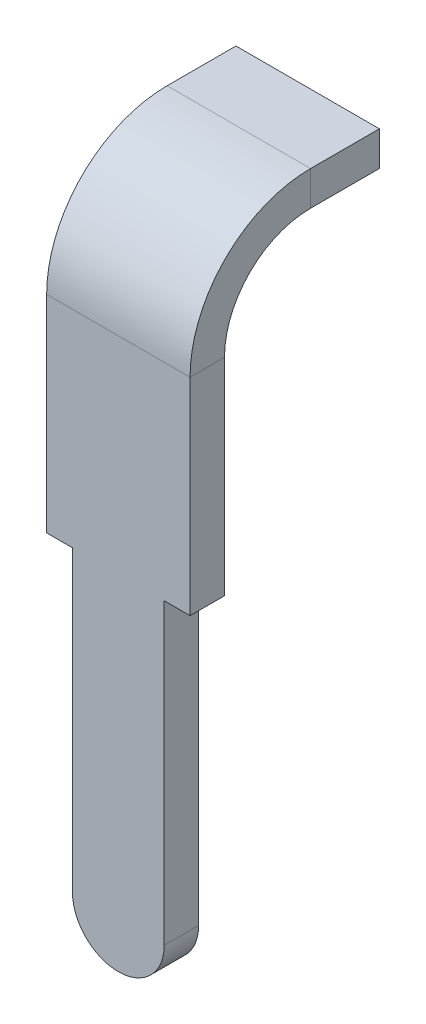
ISO-10303-21;
HEADER;
FILE_DESCRIPTION(('STEP AP214'),'2;1');
FILE_NAME('part.step','',(''),(''),'','','');
FILE_SCHEMA(('AUTOMOTIVE_DESIGN { 1 0 10303 214 1 1 1 1 }'));
ENDSEC;
DATA;
#1=APPLICATION_CONTEXT('core data for automotive mechanical design processes');
#2=APPLICATION_PROTOCOL_DEFINITION('international standard','automotive_design',2000,#1);
#3=PRODUCT_CONTEXT('',#1,'mechanical');
#4=PRODUCT('Part','Part','',(#3));
#5=PRODUCT_RELATED_PRODUCT_CATEGORY('part','',(#4));
#6=PRODUCT_DEFINITION_FORMATION('','',#4);
#7=PRODUCT_DEFINITION_CONTEXT('part definition',#1,'design');
#8=PRODUCT_DEFINITION('design','',#6,#7);
#9=PRODUCT_DEFINITION_SHAPE('','',#8);
#10=(LENGTH_UNIT() NAMED_UNIT(*) SI_UNIT(.MILLI.,.METRE.));
#11=(NAMED_UNIT(*) PLANE_ANGLE_UNIT() SI_UNIT($,.RADIAN.));
#12=(NAMED_UNIT(*) SI_UNIT($,.STERADIAN.) SOLID_ANGLE_UNIT());
#13=UNCERTAINTY_MEASURE_WITH_UNIT(LENGTH_MEASURE(1.E-05),#10,'distance_accuracy_value','');
#14=(GEOMETRIC_REPRESENTATION_CONTEXT(3) GLOBAL_UNCERTAINTY_ASSIGNED_CONTEXT((#13)) GLOBAL_UNIT_ASSIGNED_CONTEXT((#10,
#11,#12)) REPRESENTATION_CONTEXT('',''));
#15=CARTESIAN_POINT('',(0.,0.,0.));
#16=DIRECTION('',(0.,0.,1.));
#17=DIRECTION('',(1.,0.,0.));
#18=AXIS2_PLACEMENT_3D('',#15,#16,#17);
#19=CARTESIAN_POINT('',(0.,-4.3,-5.5));
#20=DIRECTION('',(0.,0.,1.));
#21=DIRECTION('',(0.,-1.,0.));
#22=AXIS2_PLACEMENT_3D('',#19,#20,#21);
#23=CYLINDRICAL_SURFACE('',#22,0.4);
#24=CARTESIAN_POINT('',(0.,-4.3,7.15));
#25=DIRECTION('',(0.,0.,1.));
#26=DIRECTION('',(1.,0.,0.));
#27=AXIS2_PLACEMENT_3D('',#24,#25,#26);
#28=CIRCLE('',#27,0.4);
#29=CARTESIAN_POINT('',(0.,-4.7,7.15));
#30=VERTEX_POINT('',#29);
#31=CARTESIAN_POINT('',(0.4,-4.3,7.15));
#32=VERTEX_POINT('',#31);
#33=EDGE_CURVE('E286',#30,#32,#28,.T.);
#34=ORIENTED_EDGE('',*,*,#33,.F.);
#35=DIRECTION('',(0.,0.,-1.));
#36=VECTOR('',#35,1.);
#37=CARTESIAN_POINT('',(0.,-4.7,6.85));
#38=LINE('',#37,#36);
#39=CARTESIAN_POINT('',(0.,-4.7,6.85));
#40=VERTEX_POINT('',#39);
#41=EDGE_CURVE('E11',#30,#40,#38,.T.);
#42=ORIENTED_EDGE('',*,*,#41,.T.);
#43=CARTESIAN_POINT('',(0.,-4.3,6.85));
#44=DIRECTION('',(0.,0.,-1.));
#45=DIRECTION('',(-1.,0.,0.));
#46=AXIS2_PLACEMENT_3D('',#43,#44,#45);
#47=CIRCLE('',#46,0.4);
#48=CARTESIAN_POINT('',(0.4,-4.3,6.85));
#49=VERTEX_POINT('',#48);
#50=EDGE_CURVE('E184',#49,#40,#47,.T.);
#51=ORIENTED_EDGE('',*,*,#50,.F.);
#52=DIRECTION('',(0.,0.,-1.));
#53=VECTOR('',#52,1.);
#54=CARTESIAN_POINT('',(0.4,-4.3,6.85));
#55=LINE('',#54,#53);
#56=EDGE_CURVE('E193',#32,#49,#55,.T.);
#57=ORIENTED_EDGE('',*,*,#56,.F.);
#58=EDGE_LOOP('',(#34,#42,#51,#57));
#59=FACE_BOUND('',#58,.T.);
#60=ADVANCED_FACE('F17',(#59),#23,.T.);
#61=CARTESIAN_POINT('',(0.,-4.3,-5.5));
#62=DIRECTION('',(0.,0.,-1.));
#63=DIRECTION('',(0.,1.,0.));
#64=AXIS2_PLACEMENT_3D('',#61,#62,#63);
#65=CYLINDRICAL_SURFACE('',#64,0.4);
#66=ORIENTED_EDGE('',*,*,#41,.F.);
#67=CARTESIAN_POINT('',(0.,-4.3,7.15));
#68=DIRECTION('',(0.,0.,1.));
#69=DIRECTION('',(1.,0.,0.));
#70=AXIS2_PLACEMENT_3D('',#67,#68,#69);
#71=CIRCLE('',#70,0.4);
#72=CARTESIAN_POINT('',(-0.4,-4.3,7.15));
#73=VERTEX_POINT('',#72);
#74=EDGE_CURVE('E282',#73,#30,#71,.T.);
#75=ORIENTED_EDGE('',*,*,#74,.F.);
#76=DIRECTION('',(0.,0.,1.));
#77=VECTOR('',#76,1.);
#78=CARTESIAN_POINT('',(-0.4,-4.3,7.15));
#79=LINE('',#78,#77);
#80=CARTESIAN_POINT('',(-0.4,-4.3,6.85));
#81=VERTEX_POINT('',#80);
#82=EDGE_CURVE('E25',#81,#73,#79,.T.);
#83=ORIENTED_EDGE('',*,*,#82,.F.);
#84=CARTESIAN_POINT('',(0.,-4.3,6.85));
#85=DIRECTION('',(0.,0.,-1.));
#86=DIRECTION('',(-1.,0.,0.));
#87=AXIS2_PLACEMENT_3D('',#84,#85,#86);
#88=CIRCLE('',#87,0.4);
#89=EDGE_CURVE('E187',#40,#81,#88,.T.);
#90=ORIENTED_EDGE('',*,*,#89,.F.);
#91=EDGE_LOOP('',(#66,#75,#83,#90));
#92=FACE_BOUND('',#91,.T.);
#93=ADVANCED_FACE('F283',(#92),#65,.T.);
#94=CARTESIAN_POINT('',(-0.4,-4.7,-5.5));
#95=DIRECTION('',(1.,0.,0.));
#96=DIRECTION('',(0.,1.,0.));
#97=AXIS2_PLACEMENT_3D('',#94,#95,#96);
#98=PLANE('',#97);
#99=DIRECTION('',(0.,-1.,0.));
#100=VECTOR('',#99,1.);
#101=CARTESIAN_POINT('',(-0.4,0.1,6.85));
#102=LINE('',#101,#100);
#103=CARTESIAN_POINT('',(-0.4,-1.7,6.85));
#104=VERTEX_POINT('',#103);
#105=EDGE_CURVE('E152',#104,#81,#102,.T.);
#106=ORIENTED_EDGE('',*,*,#105,.T.);
#107=ORIENTED_EDGE('',*,*,#82,.T.);
#108=DIRECTION('',(0.,1.,0.));
#109=VECTOR('',#108,1.);
#110=CARTESIAN_POINT('',(-0.4,-4.7,7.15));
#111=LINE('',#110,#109);
#112=CARTESIAN_POINT('',(-0.4,-1.7,7.15));
#113=VERTEX_POINT('',#112);
#114=EDGE_CURVE('E173',#73,#113,#111,.T.);
#115=ORIENTED_EDGE('',*,*,#114,.T.);
#116=DIRECTION('',(0.,0.,1.));
#117=VECTOR('',#116,1.);
#118=CARTESIAN_POINT('',(-0.4,-1.7,-5.5));
#119=LINE('',#118,#117);
#120=EDGE_CURVE('E268',#104,#113,#119,.T.);
#121=ORIENTED_EDGE('',*,*,#120,.F.);
#122=EDGE_LOOP('',(#106,#107,#115,#121));
#123=FACE_BOUND('',#122,.T.);
#124=ADVANCED_FACE('F274',(#123),#98,.F.);
#125=CARTESIAN_POINT('',(-0.625,-1.7,-5.5));
#126=DIRECTION('',(0.,1.,0.));
#127=DIRECTION('',(1.,0.,0.));
#128=AXIS2_PLACEMENT_3D('',#125,#126,#127);
#129=PLANE('',#128);
#130=DIRECTION('',(1.,0.,0.));
#131=VECTOR('',#130,1.);
#132=CARTESIAN_POINT('',(-0.625,-1.7,6.85));
#133=LINE('',#132,#131);
#134=CARTESIAN_POINT('',(-0.625,-1.7,6.85));
#135=VERTEX_POINT('',#134);
#136=EDGE_CURVE('E143',#135,#104,#133,.T.);
#137=ORIENTED_EDGE('',*,*,#136,.T.);
#138=ORIENTED_EDGE('',*,*,#120,.T.);
#139=DIRECTION('',(-1.,0.,0.));
#140=VECTOR('',#139,1.);
#141=CARTESIAN_POINT('',(-0.625,-1.7,7.15));
#142=LINE('',#141,#140);
#143=CARTESIAN_POINT('',(-0.625,-1.7,7.15));
#144=VERTEX_POINT('',#143);
#145=EDGE_CURVE('E170',#113,#144,#142,.T.);
#146=ORIENTED_EDGE('',*,*,#145,.T.);
#147=DIRECTION('',(0.,0.,1.));
#148=VECTOR('',#147,1.);
#149=CARTESIAN_POINT('',(-0.625,-1.7,-5.5));
#150=LINE('',#149,#148);
#151=EDGE_CURVE('E161',#135,#144,#150,.T.);
#152=ORIENTED_EDGE('',*,*,#151,.F.);
#153=EDGE_LOOP('',(#137,#138,#146,#152));
#154=FACE_BOUND('',#153,.T.);
#155=ADVANCED_FACE('F168',(#154),#129,.F.);
#156=CARTESIAN_POINT('',(0.625,-1.7,-5.5));
#157=DIRECTION('',(0.,1.,0.));
#158=DIRECTION('',(1.,0.,0.));
#159=AXIS2_PLACEMENT_3D('',#156,#157,#158);
#160=PLANE('',#159);
#161=DIRECTION('',(1.,0.,0.));
#162=VECTOR('',#161,1.);
#163=CARTESIAN_POINT('',(-0.625,-1.7,6.85));
#164=LINE('',#163,#162);
#165=CARTESIAN_POINT('',(0.4,-1.7,6.85));
#166=VERTEX_POINT('',#165);
#167=CARTESIAN_POINT('',(0.625,-1.7,6.85));
#168=VERTEX_POINT('',#167);
#169=EDGE_CURVE('E203',#166,#168,#164,.T.);
#170=ORIENTED_EDGE('',*,*,#169,.T.);
#171=DIRECTION('',(0.,0.,1.));
#172=VECTOR('',#171,1.);
#173=CARTESIAN_POINT('',(0.625,-1.7,-5.5));
#174=LINE('',#173,#172);
#175=CARTESIAN_POINT('',(0.625,-1.7,7.15));
#176=VERTEX_POINT('',#175);
#177=EDGE_CURVE('E207',#168,#176,#174,.T.);
#178=ORIENTED_EDGE('',*,*,#177,.T.);
#179=DIRECTION('',(-1.,0.,0.));
#180=VECTOR('',#179,1.);
#181=CARTESIAN_POINT('',(0.625,-1.7,7.15));
#182=LINE('',#181,#180);
#183=CARTESIAN_POINT('',(0.4,-1.7,7.15));
#184=VERTEX_POINT('',#183);
#185=EDGE_CURVE('E297',#176,#184,#182,.T.);
#186=ORIENTED_EDGE('',*,*,#185,.T.);
#187=DIRECTION('',(0.,0.,1.));
#188=VECTOR('',#187,1.);
#189=CARTESIAN_POINT('',(0.4,-1.7,-5.5));
#190=LINE('',#189,#188);
#191=EDGE_CURVE('E196',#166,#184,#190,.T.);
#192=ORIENTED_EDGE('',*,*,#191,.F.);
#193=EDGE_LOOP('',(#170,#178,#186,#192));
#194=FACE_BOUND('',#193,.T.);
#195=ADVANCED_FACE('F342',(#194),#160,.F.);
#196=CARTESIAN_POINT('',(0.4,-4.7,-5.5));
#197=DIRECTION('',(-1.,0.,0.));
#198=DIRECTION('',(0.,0.,1.));
#199=AXIS2_PLACEMENT_3D('',#196,#197,#198);
#200=PLANE('',#199);
#201=DIRECTION('',(0.,-1.,0.));
#202=VECTOR('',#201,1.);
#203=CARTESIAN_POINT('',(0.4,-4.7,7.15));
#204=LINE('',#203,#202);
#205=EDGE_CURVE('E292',#184,#32,#204,.T.);
#206=ORIENTED_EDGE('',*,*,#205,.T.);
#207=ORIENTED_EDGE('',*,*,#56,.T.);
#208=DIRECTION('',(0.,1.,0.));
#209=VECTOR('',#208,1.);
#210=CARTESIAN_POINT('',(0.4,0.1,6.85));
#211=LINE('',#210,#209);
#212=EDGE_CURVE('E166',#49,#166,#211,.T.);
#213=ORIENTED_EDGE('',*,*,#212,.T.);
#214=ORIENTED_EDGE('',*,*,#191,.T.);
#215=EDGE_LOOP('',(#206,#207,#213,#214));
#216=FACE_BOUND('',#215,.T.);
#217=ADVANCED_FACE('F345',(#216),#200,.F.);
#218=CARTESIAN_POINT('',(0.,0.,5.5));
#219=DIRECTION('',(0.,0.,1.));
#220=DIRECTION('',(1.,0.,0.));
#221=AXIS2_PLACEMENT_3D('',#218,#219,#220);
#222=PLANE('',#221);
#223=DIRECTION('',(0.,1.,0.));
#224=VECTOR('',#223,1.);
#225=CARTESIAN_POINT('',(0.625,1.15,5.5));
#226=LINE('',#225,#224);
#227=CARTESIAN_POINT('',(0.625,0.85,5.5));
#228=VERTEX_POINT('',#227);
#229=CARTESIAN_POINT('',(0.625,1.15,5.5));
#230=VERTEX_POINT('',#229);
#231=EDGE_CURVE('E248',#228,#230,#226,.T.);
#232=ORIENTED_EDGE('',*,*,#231,.F.);
#233=DIRECTION('',(1.,0.,0.));
#234=VECTOR('',#233,1.);
#235=CARTESIAN_POINT('',(-0.625,0.85,5.5));
#236=LINE('',#235,#234);
#237=CARTESIAN_POINT('',(-0.625,0.85,5.5));
#238=VERTEX_POINT('',#237);
#239=EDGE_CURVE('E37',#238,#228,#236,.T.);
#240=ORIENTED_EDGE('',*,*,#239,.F.);
#241=DIRECTION('',(0.,-1.,0.));
#242=VECTOR('',#241,1.);
#243=CARTESIAN_POINT('',(-0.625,1.15,5.5));
#244=LINE('',#243,#242);
#245=CARTESIAN_POINT('',(-0.625,1.15,5.5));
#246=VERTEX_POINT('',#245);
#247=EDGE_CURVE('E44',#246,#238,#244,.T.);
#248=ORIENTED_EDGE('',*,*,#247,.F.);
#249=DIRECTION('',(-1.,0.,0.));
#250=VECTOR('',#249,1.);
#251=CARTESIAN_POINT('',(-0.625,1.15,5.5));
#252=LINE('',#251,#250);
#253=EDGE_CURVE('E222',#230,#246,#252,.T.);
#254=ORIENTED_EDGE('',*,*,#253,.F.);
#255=EDGE_LOOP('',(#232,#240,#248,#254));
#256=FACE_BOUND('',#255,.T.);
#257=ADVANCED_FACE('F365',(#256),#222,.F.);
#258=CARTESIAN_POINT('',(-0.625,0.85,6.1));
#259=DIRECTION('',(0.,1.,0.));
#260=DIRECTION('',(1.,0.,0.));
#261=AXIS2_PLACEMENT_3D('',#258,#259,#260);
#262=PLANE('',#261);
#263=ORIENTED_EDGE('',*,*,#239,.T.);
#264=DIRECTION('',(0.,0.,-1.));
#265=VECTOR('',#264,1.);
#266=CARTESIAN_POINT('',(0.625,0.85,6.1));
#267=LINE('',#266,#265);
#268=CARTESIAN_POINT('',(0.625,0.85,6.1));
#269=VERTEX_POINT('',#268);
#270=EDGE_CURVE('E227',#269,#228,#267,.T.);
#271=ORIENTED_EDGE('',*,*,#270,.F.);
#272=DIRECTION('',(1.,0.,0.));
#273=VECTOR('',#272,1.);
#274=CARTESIAN_POINT('',(-0.625,0.85,6.1));
#275=LINE('',#274,#273);
#276=CARTESIAN_POINT('',(-0.625,0.85,6.1));
#277=VERTEX_POINT('',#276);
#278=EDGE_CURVE('E237',#277,#269,#275,.T.);
#279=ORIENTED_EDGE('',*,*,#278,.F.);
#280=DIRECTION('',(0.,0.,-1.));
#281=VECTOR('',#280,1.);
#282=CARTESIAN_POINT('',(-0.625,0.85,6.1));
#283=LINE('',#282,#281);
#284=EDGE_CURVE('E263',#277,#238,#283,.T.);
#285=ORIENTED_EDGE('',*,*,#284,.T.);
#286=EDGE_LOOP('',(#263,#271,#279,#285));
#287=FACE_BOUND('',#286,.T.);
#288=ADVANCED_FACE('F361',(#287),#262,.F.);
#289=CARTESIAN_POINT('',(-0.625,1.15,6.1));
#290=DIRECTION('',(1.,0.,0.));
#291=DIRECTION('',(0.,1.,0.));
#292=AXIS2_PLACEMENT_3D('',#289,#290,#291);
#293=PLANE('',#292);
#294=ORIENTED_EDGE('',*,*,#247,.T.);
#295=ORIENTED_EDGE('',*,*,#284,.F.);
#296=DIRECTION('',(0.,-1.,0.));
#297=VECTOR('',#296,1.);
#298=CARTESIAN_POINT('',(-0.625,1.15,6.1));
#299=LINE('',#298,#297);
#300=CARTESIAN_POINT('',(-0.625,1.15,6.1));
#301=VERTEX_POINT('',#300);
#302=EDGE_CURVE('E230',#301,#277,#299,.T.);
#303=ORIENTED_EDGE('',*,*,#302,.F.);
#304=DIRECTION('',(0.,0.,-1.));
#305=VECTOR('',#304,1.);
#306=CARTESIAN_POINT('',(-0.625,1.15,6.1));
#307=LINE('',#306,#305);
#308=EDGE_CURVE('E226',#301,#246,#307,.T.);
#309=ORIENTED_EDGE('',*,*,#308,.T.);
#310=EDGE_LOOP('',(#294,#295,#303,#309));
#311=FACE_BOUND('',#310,.T.);
#312=ADVANCED_FACE('F364',(#311),#293,.F.);
#313=CARTESIAN_POINT('',(-0.625,1.15,6.1));
#314=DIRECTION('',(0.,-1.,0.));
#315=DIRECTION('',(0.,0.,-1.));
#316=AXIS2_PLACEMENT_3D('',#313,#314,#315);
#317=PLANE('',#316);
#318=ORIENTED_EDGE('',*,*,#253,.T.);
#319=ORIENTED_EDGE('',*,*,#308,.F.);
#320=DIRECTION('',(-1.,0.,0.));
#321=VECTOR('',#320,1.);
#322=CARTESIAN_POINT('',(-0.625,1.15,6.1));
#323=LINE('',#322,#321);
#324=CARTESIAN_POINT('',(0.625,1.15,6.1));
#325=VERTEX_POINT('',#324);
#326=EDGE_CURVE('E214',#325,#301,#323,.T.);
#327=ORIENTED_EDGE('',*,*,#326,.F.);
#328=DIRECTION('',(0.,0.,-1.));
#329=VECTOR('',#328,1.);
#330=CARTESIAN_POINT('',(0.625,1.15,6.1));
#331=LINE('',#330,#329);
#332=EDGE_CURVE('E252',#325,#230,#331,.T.);
#333=ORIENTED_EDGE('',*,*,#332,.T.);
#334=EDGE_LOOP('',(#318,#319,#327,#333));
#335=FACE_BOUND('',#334,.T.);
#336=ADVANCED_FACE('F367',(#335),#317,.F.);
#337=CARTESIAN_POINT('',(0.625,1.15,6.1));
#338=DIRECTION('',(-1.,0.,0.));
#339=DIRECTION('',(0.,1.,0.));
#340=AXIS2_PLACEMENT_3D('',#337,#338,#339);
#341=PLANE('',#340);
#342=ORIENTED_EDGE('',*,*,#231,.T.);
#343=ORIENTED_EDGE('',*,*,#332,.F.);
#344=DIRECTION('',(0.,1.,0.));
#345=VECTOR('',#344,1.);
#346=CARTESIAN_POINT('',(0.625,1.15,6.1));
#347=LINE('',#346,#345);
#348=EDGE_CURVE('E244',#269,#325,#347,.T.);
#349=ORIENTED_EDGE('',*,*,#348,.F.);
#350=ORIENTED_EDGE('',*,*,#270,.T.);
#351=EDGE_LOOP('',(#342,#343,#349,#350));
#352=FACE_BOUND('',#351,.T.);
#353=ADVANCED_FACE('F370',(#352),#341,.F.);
#354=CARTESIAN_POINT('',(0.625,1.15,6.1));
#355=DIRECTION('',(1.,0.,0.));
#356=DIRECTION('',(0.,1.,0.));
#357=AXIS2_PLACEMENT_3D('',#354,#355,#356);
#358=PLANE('',#357);
#359=ORIENTED_EDGE('',*,*,#348,.T.);
#360=CARTESIAN_POINT('',(0.625,0.1,6.1));
#361=DIRECTION('',(1.,0.,0.));
#362=DIRECTION('',(0.,0.,-1.));
#363=AXIS2_PLACEMENT_3D('',#360,#361,#362);
#364=CIRCLE('',#363,1.05);
#365=CARTESIAN_POINT('',(0.625,0.09999999999999,7.15));
#366=VERTEX_POINT('',#365);
#367=EDGE_CURVE('E221',#325,#366,#364,.T.);
#368=ORIENTED_EDGE('',*,*,#367,.T.);
#369=DIRECTION('',(0.,0.,1.));
#370=VECTOR('',#369,1.);
#371=CARTESIAN_POINT('',(0.625,0.09999999999999,7.15));
#372=LINE('',#371,#370);
#373=CARTESIAN_POINT('',(0.625,0.1,6.85));
#374=VERTEX_POINT('',#373);
#375=EDGE_CURVE('E210',#374,#366,#372,.T.);
#376=ORIENTED_EDGE('',*,*,#375,.F.);
#377=CARTESIAN_POINT('',(0.625,0.1,6.1));
#378=DIRECTION('',(1.,0.,0.));
#379=DIRECTION('',(0.,0.,-1.));
#380=AXIS2_PLACEMENT_3D('',#377,#378,#379);
#381=CIRCLE('',#380,0.75);
#382=EDGE_CURVE('E241',#269,#374,#381,.T.);
#383=ORIENTED_EDGE('',*,*,#382,.F.);
#384=EDGE_LOOP('',(#359,#368,#376,#383));
#385=FACE_BOUND('',#384,.T.);
#386=ADVANCED_FACE('F374',(#385),#358,.T.);
#387=CARTESIAN_POINT('',(0.,0.1,6.1));
#388=DIRECTION('',(1.,0.,0.));
#389=DIRECTION('',(0.,0.,-1.));
#390=AXIS2_PLACEMENT_3D('',#387,#388,#389);
#391=CYLINDRICAL_SURFACE('',#390,0.75);
#392=ORIENTED_EDGE('',*,*,#278,.T.);
#393=ORIENTED_EDGE('',*,*,#382,.T.);
#394=DIRECTION('',(1.,0.,0.));
#395=VECTOR('',#394,1.);
#396=CARTESIAN_POINT('',(-0.625,0.1,6.85));
#397=LINE('',#396,#395);
#398=CARTESIAN_POINT('',(-0.625,0.1,6.85));
#399=VERTEX_POINT('',#398);
#400=EDGE_CURVE('E156',#399,#374,#397,.T.);
#401=ORIENTED_EDGE('',*,*,#400,.F.);
#402=CARTESIAN_POINT('',(-0.625,0.1,6.1));
#403=DIRECTION('',(1.,0.,0.));
#404=DIRECTION('',(0.,0.,-1.));
#405=AXIS2_PLACEMENT_3D('',#402,#403,#404);
#406=CIRCLE('',#405,0.75);
#407=EDGE_CURVE('E234',#277,#399,#406,.T.);
#408=ORIENTED_EDGE('',*,*,#407,.F.);
#409=EDGE_LOOP('',(#392,#393,#401,#408));
#410=FACE_BOUND('',#409,.T.);
#411=ADVANCED_FACE('F333',(#410),#391,.F.);
#412=CARTESIAN_POINT('',(-0.625,1.15,6.1));
#413=DIRECTION('',(-1.,0.,0.));
#414=DIRECTION('',(0.,0.,1.));
#415=AXIS2_PLACEMENT_3D('',#412,#413,#414);
#416=PLANE('',#415);
#417=ORIENTED_EDGE('',*,*,#302,.T.);
#418=ORIENTED_EDGE('',*,*,#407,.T.);
#419=DIRECTION('',(0.,0.,-1.));
#420=VECTOR('',#419,1.);
#421=CARTESIAN_POINT('',(-0.625,0.09999999999999,7.15));
#422=LINE('',#421,#420);
#423=CARTESIAN_POINT('',(-0.625,0.09999999999999,7.15));
#424=VERTEX_POINT('',#423);
#425=EDGE_CURVE('E164',#424,#399,#422,.T.);
#426=ORIENTED_EDGE('',*,*,#425,.F.);
#427=CARTESIAN_POINT('',(-0.625,0.1,6.1));
#428=DIRECTION('',(1.,0.,0.));
#429=DIRECTION('',(0.,0.,-1.));
#430=AXIS2_PLACEMENT_3D('',#427,#428,#429);
#431=CIRCLE('',#430,1.05);
#432=EDGE_CURVE('E218',#301,#424,#431,.T.);
#433=ORIENTED_EDGE('',*,*,#432,.F.);
#434=EDGE_LOOP('',(#417,#418,#426,#433));
#435=FACE_BOUND('',#434,.T.);
#436=ADVANCED_FACE('F328',(#435),#416,.T.);
#437=CARTESIAN_POINT('',(0.,0.1,6.1));
#438=DIRECTION('',(1.,0.,0.));
#439=DIRECTION('',(0.,0.,-1.));
#440=AXIS2_PLACEMENT_3D('',#437,#438,#439);
#441=CYLINDRICAL_SURFACE('',#440,1.05);
#442=ORIENTED_EDGE('',*,*,#326,.T.);
#443=ORIENTED_EDGE('',*,*,#432,.T.);
#444=DIRECTION('',(-1.,0.,0.));
#445=VECTOR('',#444,1.);
#446=CARTESIAN_POINT('',(-0.625,0.09999999999999,7.15));
#447=LINE('',#446,#445);
#448=EDGE_CURVE('E308',#366,#424,#447,.T.);
#449=ORIENTED_EDGE('',*,*,#448,.F.);
#450=ORIENTED_EDGE('',*,*,#367,.F.);
#451=EDGE_LOOP('',(#442,#443,#449,#450));
#452=FACE_BOUND('',#451,.T.);
#453=ADVANCED_FACE('F324',(#452),#441,.T.);
#454=CARTESIAN_POINT('',(0.625,0.09999999999999,7.15));
#455=DIRECTION('',(1.,0.,0.));
#456=DIRECTION('',(0.,0.,1.));
#457=AXIS2_PLACEMENT_3D('',#454,#455,#456);
#458=PLANE('',#457);
#459=ORIENTED_EDGE('',*,*,#177,.F.);
#460=DIRECTION('',(0.,-1.,0.));
#461=VECTOR('',#460,1.);
#462=CARTESIAN_POINT('',(0.625,0.1,6.85));
#463=LINE('',#462,#461);
#464=EDGE_CURVE('E199',#374,#168,#463,.T.);
#465=ORIENTED_EDGE('',*,*,#464,.F.);
#466=ORIENTED_EDGE('',*,*,#375,.T.);
#467=DIRECTION('',(0.,-1.,0.));
#468=VECTOR('',#467,1.);
#469=CARTESIAN_POINT('',(0.625,0.09999999999999,7.15));
#470=LINE('',#469,#468);
#471=EDGE_CURVE('E300',#366,#176,#470,.T.);
#472=ORIENTED_EDGE('',*,*,#471,.T.);
#473=EDGE_LOOP('',(#459,#465,#466,#472));
#474=FACE_BOUND('',#473,.T.);
#475=ADVANCED_FACE('F340',(#474),#458,.T.);
#476=CARTESIAN_POINT('',(-0.625,0.1,6.85));
#477=DIRECTION('',(0.,0.,-1.));
#478=DIRECTION('',(0.,-1.,0.));
#479=AXIS2_PLACEMENT_3D('',#476,#477,#478);
#480=PLANE('',#479);
#481=ORIENTED_EDGE('',*,*,#212,.F.);
#482=ORIENTED_EDGE('',*,*,#50,.T.);
#483=ORIENTED_EDGE('',*,*,#89,.T.);
#484=ORIENTED_EDGE('',*,*,#105,.F.);
#485=ORIENTED_EDGE('',*,*,#136,.F.);
#486=DIRECTION('',(0.,-1.,0.));
#487=VECTOR('',#486,1.);
#488=CARTESIAN_POINT('',(-0.625,0.1,6.85));
#489=LINE('',#488,#487);
#490=EDGE_CURVE('E148',#399,#135,#489,.T.);
#491=ORIENTED_EDGE('',*,*,#490,.F.);
#492=ORIENTED_EDGE('',*,*,#400,.T.);
#493=ORIENTED_EDGE('',*,*,#464,.T.);
#494=ORIENTED_EDGE('',*,*,#169,.F.);
#495=EDGE_LOOP('',(#481,#482,#483,#484,#485,#491,#492,#493,#494));
#496=FACE_BOUND('',#495,.T.);
#497=ADVANCED_FACE('F146',(#496),#480,.T.);
#498=CARTESIAN_POINT('',(-0.625,0.09999999999999,7.15));
#499=DIRECTION('',(-1.,0.,0.));
#500=DIRECTION('',(0.,0.,1.));
#501=AXIS2_PLACEMENT_3D('',#498,#499,#500);
#502=PLANE('',#501);
#503=ORIENTED_EDGE('',*,*,#151,.T.);
#504=DIRECTION('',(0.,-1.,0.));
#505=VECTOR('',#504,1.);
#506=CARTESIAN_POINT('',(-0.625,0.09999999999999,7.15));
#507=LINE('',#506,#505);
#508=EDGE_CURVE('E312',#424,#144,#507,.T.);
#509=ORIENTED_EDGE('',*,*,#508,.F.);
#510=ORIENTED_EDGE('',*,*,#425,.T.);
#511=ORIENTED_EDGE('',*,*,#490,.T.);
#512=EDGE_LOOP('',(#503,#509,#510,#511));
#513=FACE_BOUND('',#512,.T.);
#514=ADVANCED_FACE('F159',(#513),#502,.T.);
#515=CARTESIAN_POINT('',(-0.625,0.09999999999999,7.15));
#516=DIRECTION('',(0.,0.,1.));
#517=DIRECTION('',(1.,0.,0.));
#518=AXIS2_PLACEMENT_3D('',#515,#516,#517);
#519=PLANE('',#518);
#520=ORIENTED_EDGE('',*,*,#74,.T.);
#521=ORIENTED_EDGE('',*,*,#33,.T.);
#522=ORIENTED_EDGE('',*,*,#205,.F.);
#523=ORIENTED_EDGE('',*,*,#185,.F.);
#524=ORIENTED_EDGE('',*,*,#471,.F.);
#525=ORIENTED_EDGE('',*,*,#448,.T.);
#526=ORIENTED_EDGE('',*,*,#508,.T.);
#527=ORIENTED_EDGE('',*,*,#145,.F.);
#528=ORIENTED_EDGE('',*,*,#114,.F.);
#529=EDGE_LOOP('',(#520,#521,#522,#523,#524,#525,#526,#527,#528));
#530=FACE_BOUND('',#529,.T.);
#531=ADVANCED_FACE('F280',(#530),#519,.T.);
#532=CLOSED_SHELL('',(#60,#93,#124,#155,#195,#217,#257,#288,#312,#336,#353,#386,#411,#436,#453,
#475,#497,#514,#531));
#533=MANIFOLD_SOLID_BREP('B1',#532);
#534=ADVANCED_BREP_SHAPE_REPRESENTATION('',(#18,#533),#14);
#535=SHAPE_DEFINITION_REPRESENTATION(#9,#534);
ENDSEC;
END-ISO-10303-21;
